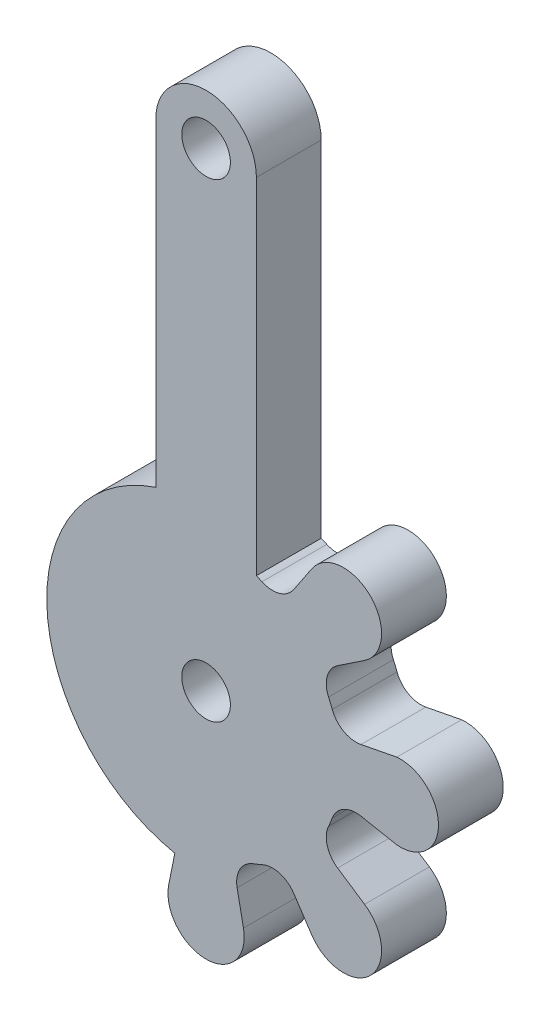
ISO-10303-21;
HEADER;
FILE_DESCRIPTION(('STEP AP214'),'2;1');
FILE_NAME('part.step','',(''),(''),'','','');
FILE_SCHEMA(('AUTOMOTIVE_DESIGN { 1 0 10303 214 1 1 1 1 }'));
ENDSEC;
DATA;
#1=APPLICATION_CONTEXT('core data for automotive mechanical design processes');
#2=APPLICATION_PROTOCOL_DEFINITION('international standard','automotive_design',2000,#1);
#3=PRODUCT_CONTEXT('',#1,'mechanical');
#4=PRODUCT('Part','Part','',(#3));
#5=PRODUCT_RELATED_PRODUCT_CATEGORY('part','',(#4));
#6=PRODUCT_DEFINITION_FORMATION('','',#4);
#7=PRODUCT_DEFINITION_CONTEXT('part definition',#1,'design');
#8=PRODUCT_DEFINITION('design','',#6,#7);
#9=PRODUCT_DEFINITION_SHAPE('','',#8);
#10=(LENGTH_UNIT() NAMED_UNIT(*) SI_UNIT(.MILLI.,.METRE.));
#11=(NAMED_UNIT(*) PLANE_ANGLE_UNIT() SI_UNIT($,.RADIAN.));
#12=(NAMED_UNIT(*) SI_UNIT($,.STERADIAN.) SOLID_ANGLE_UNIT());
#13=UNCERTAINTY_MEASURE_WITH_UNIT(LENGTH_MEASURE(1.E-05),#10,'distance_accuracy_value','');
#14=(GEOMETRIC_REPRESENTATION_CONTEXT(3) GLOBAL_UNCERTAINTY_ASSIGNED_CONTEXT((#13)) GLOBAL_UNIT_ASSIGNED_CONTEXT((#10,
#11,#12)) REPRESENTATION_CONTEXT('',''));
#15=CARTESIAN_POINT('',(0.,0.,0.));
#16=DIRECTION('',(0.,0.,1.));
#17=DIRECTION('',(1.,0.,0.));
#18=AXIS2_PLACEMENT_3D('',#15,#16,#17);
#19=CARTESIAN_POINT('',(13.9321787238471,5.32807153857671,4.));
#20=DIRECTION('',(0.,0.,1.));
#21=DIRECTION('',(1.,0.,0.));
#22=AXIS2_PLACEMENT_3D('',#19,#20,#21);
#23=PLANE('',#22);
#24=CARTESIAN_POINT('',(9.8292801499656,14.3157003697505,4.));
#25=DIRECTION('',(0.,0.,1.));
#26=DIRECTION('',(1.,0.,0.));
#27=AXIS2_PLACEMENT_3D('',#24,#25,#26);
#28=CIRCLE('',#27,1.50000000000068);
#29=CARTESIAN_POINT('',(11.3292801499663,14.3157003697505,4.));
#30=VERTEX_POINT('',#29);
#31=EDGE_CURVE('E247',#30,#30,#28,.T.);
#32=ORIENTED_EDGE('',*,*,#31,.F.);
#33=EDGE_LOOP('',(#32));
#34=FACE_BOUND('',#33,.T.);
#35=CARTESIAN_POINT('',(13.9321787238471,5.32807153857671,4.));
#36=DIRECTION('',(0.,0.,-1.));
#37=DIRECTION('',(1.,0.,0.));
#38=AXIS2_PLACEMENT_3D('',#35,#36,#37);
#39=CIRCLE('',#38,1.56930132758327);
#40=CARTESIAN_POINT('',(13.2804795223911,6.75565509478481,4.));
#41=VERTEX_POINT('',#40);
#42=CARTESIAN_POINT('',(15.238123377051,6.19825268038543,4.));
#43=VERTEX_POINT('',#42);
#44=EDGE_CURVE('E299',#41,#43,#39,.T.);
#45=ORIENTED_EDGE('',*,*,#44,.T.);
#46=DIRECTION('',(0.554502265815547,-0.832182213944413,0.));
#47=VECTOR('',#46,1.);
#48=CARTESIAN_POINT('',(15.238123377051,6.19825268038543,4.));
#49=LINE('',#48,#47);
#50=CARTESIAN_POINT('',(16.347575877791,4.53321595240375,4.));
#51=VERTEX_POINT('',#50);
#52=EDGE_CURVE('E149',#43,#51,#49,.T.);
#53=ORIENTED_EDGE('',*,*,#52,.T.);
#54=CARTESIAN_POINT('',(18.3064928575966,5.83848766511686,4.));
#55=DIRECTION('',(0.,0.,1.));
#56=DIRECTION('',(1.,0.,0.));
#57=AXIS2_PLACEMENT_3D('',#54,#55,#56);
#58=CIRCLE('',#57,2.35395199212414);
#59=CARTESIAN_POINT('',(19.6117645707153,7.79740464553143,4.));
#60=VERTEX_POINT('',#59);
#61=EDGE_CURVE('E370',#51,#60,#58,.T.);
#62=ORIENTED_EDGE('',*,*,#61,.T.);
#63=DIRECTION('',(-0.832182213937977,0.554502265825206,0.));
#64=VECTOR('',#63,1.);
#65=CARTESIAN_POINT('',(19.6117645703094,7.79740464492227,4.));
#66=LINE('',#65,#64);
#67=CARTESIAN_POINT('',(17.9467278431534,8.90685714513997,4.));
#68=VERTEX_POINT('',#67);
#69=EDGE_CURVE('E391',#60,#68,#66,.T.);
#70=ORIENTED_EDGE('',*,*,#69,.T.);
#71=CARTESIAN_POINT('',(18.8169089841364,10.212801798866,4.));
#72=DIRECTION('',(0.,0.,-1.));
#73=DIRECTION('',(1.,0.,0.));
#74=AXIS2_PLACEMENT_3D('',#71,#72,#73);
#75=CIRCLE('',#74,1.56930132908232);
#76=CARTESIAN_POINT('',(17.3893254268235,10.864500999686,4.));
#77=VERTEX_POINT('',#76);
#78=EDGE_CURVE('E388',#68,#77,#75,.T.);
#79=ORIENTED_EDGE('',*,*,#78,.T.);
#80=CARTESIAN_POINT('',(9.8292801499656,14.3157003697505,4.));
#81=DIRECTION('',(0.,0.,1.));
#82=DIRECTION('',(1.,0.,0.));
#83=AXIS2_PLACEMENT_3D('',#80,#81,#82);
#84=CIRCLE('',#83,8.31053919231774);
#85=CARTESIAN_POINT('',(17.615405909383,11.4103075691836,4.));
#86=VERTEX_POINT('',#85);
#87=EDGE_CURVE('E390',#77,#86,#84,.T.);
#88=ORIENTED_EDGE('',*,*,#87,.T.);
#89=CARTESIAN_POINT('',(19.0856808472915,10.8616744805369,4.));
#90=DIRECTION('',(0.,0.,-1.));
#91=DIRECTION('',(1.,0.,0.));
#92=AXIS2_PLACEMENT_3D('',#89,#90,#91);
#93=CIRCLE('',#92,1.56930132735953);
#94=CARTESIAN_POINT('',(19.3938121838805,12.4004277861269,4.));
#95=VERTEX_POINT('',#94);
#96=EDGE_CURVE('E393',#86,#95,#93,.T.);
#97=ORIENTED_EDGE('',*,*,#96,.T.);
#98=DIRECTION('',(0.981664134892741,-0.190618798299869,0.));
#99=VECTOR('',#98,1.);
#100=CARTESIAN_POINT('',(19.3938121838389,12.400427785919,4.));
#101=LINE('',#100,#99);
#102=CARTESIAN_POINT('',(21.6017659324175,11.9716889991019,4.));
#103=VERTEX_POINT('',#102);
#104=EDGE_CURVE('E399',#95,#103,#101,.T.);
#105=ORIENTED_EDGE('',*,*,#104,.T.);
#106=CARTESIAN_POINT('',(21.8178693311427,14.3157003697505,4.));
#107=DIRECTION('',(0.,0.,1.));
#108=DIRECTION('',(1.,0.,0.));
#109=AXIS2_PLACEMENT_3D('',#106,#107,#108);
#110=CIRCLE('',#109,2.35395199285594);
#111=CARTESIAN_POINT('',(21.6017659324176,16.6597117403991,4.));
#112=VERTEX_POINT('',#111);
#113=EDGE_CURVE('E401',#103,#112,#110,.T.);
#114=ORIENTED_EDGE('',*,*,#113,.T.);
#115=DIRECTION('',(-0.981664135105262,-0.190618797205412,0.));
#116=VECTOR('',#115,1.);
#117=CARTESIAN_POINT('',(21.6017659324176,16.6597117403991,4.));
#118=LINE('',#117,#116);
#119=CARTESIAN_POINT('',(19.3938121821458,16.2309729558077,4.));
#120=VERTEX_POINT('',#119);
#121=EDGE_CURVE('E403',#112,#120,#118,.T.);
#122=ORIENTED_EDGE('',*,*,#121,.T.);
#123=CARTESIAN_POINT('',(19.0856808472915,17.7697262619614,4.));
#124=DIRECTION('',(0.,0.,-1.));
#125=DIRECTION('',(1.,0.,0.));
#126=AXIS2_PLACEMENT_3D('',#123,#124,#125);
#127=CIRCLE('',#126,1.56930132882255);
#128=CARTESIAN_POINT('',(17.6154059088652,17.2210931732038,4.));
#129=VERTEX_POINT('',#128);
#130=EDGE_CURVE('E405',#120,#129,#127,.T.);
#131=ORIENTED_EDGE('',*,*,#130,.T.);
#132=CARTESIAN_POINT('',(9.8292801499656,14.3157003697505,4.));
#133=DIRECTION('',(0.,0.,1.));
#134=DIRECTION('',(1.,0.,0.));
#135=AXIS2_PLACEMENT_3D('',#132,#133,#134);
#136=CIRCLE('',#135,8.31053919372383);
#137=CARTESIAN_POINT('',(17.3893254266881,17.7668997416103,4.));
#138=VERTEX_POINT('',#137);
#139=EDGE_CURVE('E407',#129,#138,#136,.T.);
#140=ORIENTED_EDGE('',*,*,#139,.T.);
#141=CARTESIAN_POINT('',(18.8169089841364,18.4185989436325,4.));
#142=DIRECTION('',(0.,0.,-1.));
#143=DIRECTION('',(1.,0.,0.));
#144=AXIS2_PLACEMENT_3D('',#141,#142,#143);
#145=CIRCLE('',#144,1.56930132758312);
#146=CARTESIAN_POINT('',(17.9467278423342,19.7245435968265,4.));
#147=VERTEX_POINT('',#146);
#148=EDGE_CURVE('E409',#138,#147,#145,.T.);
#149=ORIENTED_EDGE('',*,*,#148,.T.);
#150=DIRECTION('',(0.832182214350146,0.554502265206633,0.));
#151=VECTOR('',#150,1.);
#152=CARTESIAN_POINT('',(17.9467278423278,19.7245435968361,4.));
#153=LINE('',#152,#151);
#154=CARTESIAN_POINT('',(19.611764569902,20.8339960955454,4.));
#155=VERTEX_POINT('',#154);
#156=EDGE_CURVE('E411',#147,#155,#153,.T.);
#157=ORIENTED_EDGE('',*,*,#156,.T.);
#158=CARTESIAN_POINT('',(18.3064928575966,22.7929130773815,4.));
#159=DIRECTION('',(0.,0.,1.));
#160=DIRECTION('',(1.,0.,0.));
#161=AXIS2_PLACEMENT_3D('',#158,#159,#160);
#162=CIRCLE('',#161,2.35395199285594);
#163=CARTESIAN_POINT('',(16.347575877182,24.0981847905003,4.));
#164=VERTEX_POINT('',#163);
#165=EDGE_CURVE('E413',#155,#164,#162,.T.);
#166=ORIENTED_EDGE('',*,*,#165,.T.);
#167=DIRECTION('',(-0.554502265825275,-0.832182213937931,0.));
#168=VECTOR('',#167,1.);
#169=CARTESIAN_POINT('',(16.347575877791,24.0981847900945,4.));
#170=LINE('',#169,#168);
#171=CARTESIAN_POINT('',(15.2381233775731,22.4331480629386,4.));
#172=VERTEX_POINT('',#171);
#173=EDGE_CURVE('E415',#164,#172,#170,.T.);
#174=ORIENTED_EDGE('',*,*,#173,.T.);
#175=CARTESIAN_POINT('',(13.9321787238471,23.3033292039215,4.));
#176=DIRECTION('',(0.,0.,-1.));
#177=DIRECTION('',(1.,0.,0.));
#178=AXIS2_PLACEMENT_3D('',#175,#176,#177);
#179=CIRCLE('',#178,1.56930132970473);
#180=CARTESIAN_POINT('',(13.2804795202887,21.8757456471746,4.));
#181=VERTEX_POINT('',#180);
#182=EDGE_CURVE('E417',#172,#181,#179,.T.);
#183=ORIENTED_EDGE('',*,*,#182,.T.);
#184=CARTESIAN_POINT('',(9.8292801499656,14.3157003697505,4.));
#185=DIRECTION('',(0.,0.,1.));
#186=DIRECTION('',(1.,0.,0.));
#187=AXIS2_PLACEMENT_3D('',#184,#185,#186);
#188=CIRCLE('',#187,8.31053919159069);
#189=CARTESIAN_POINT('',(12.9342801499661,22.024399135104,4.));
#190=VERTEX_POINT('',#189);
#191=EDGE_CURVE('E419',#181,#190,#188,.T.);
#192=ORIENTED_EDGE('',*,*,#191,.T.);
#193=DIRECTION('',(0.,1.,0.));
#194=VECTOR('',#193,1.);
#195=CARTESIAN_POINT('',(12.9342801499661,43.3157003697502,4.));
#196=LINE('',#195,#194);
#197=CARTESIAN_POINT('',(12.9342801499661,43.3157003697502,4.));
#198=VERTEX_POINT('',#197);
#199=EDGE_CURVE('E421',#190,#198,#196,.T.);
#200=ORIENTED_EDGE('',*,*,#199,.T.);
#201=CARTESIAN_POINT('',(9.82928014996628,43.3157003697502,4.));
#202=DIRECTION('',(0.,0.,1.));
#203=DIRECTION('',(1.,0.,0.));
#204=AXIS2_PLACEMENT_3D('',#201,#202,#203);
#205=CIRCLE('',#204,3.10499999999993);
#206=CARTESIAN_POINT('',(6.72428014996635,43.3157003697502,4.));
#207=VERTEX_POINT('',#206);
#208=EDGE_CURVE('E423',#198,#207,#205,.T.);
#209=ORIENTED_EDGE('',*,*,#208,.T.);
#210=DIRECTION('',(0.,-1.,0.));
#211=VECTOR('',#210,1.);
#212=CARTESIAN_POINT('',(6.72428014996626,43.3157003697502,4.));
#213=LINE('',#212,#211);
#214=CARTESIAN_POINT('',(6.72428014996626,23.6450642950133,4.));
#215=VERTEX_POINT('',#214);
#216=EDGE_CURVE('E425',#207,#215,#213,.T.);
#217=ORIENTED_EDGE('',*,*,#216,.T.);
#218=CARTESIAN_POINT('',(9.8292801499656,14.3157003697505,4.));
#219=DIRECTION('',(0.,0.,1.));
#220=DIRECTION('',(1.,0.,0.));
#221=AXIS2_PLACEMENT_3D('',#218,#219,#220);
#222=CIRCLE('',#221,9.83249999999987);
#223=CARTESIAN_POINT('',(7.89867492113485,4.67459982570427,4.));
#224=VERTEX_POINT('',#223);
#225=EDGE_CURVE('E427',#215,#224,#222,.T.);
#226=ORIENTED_EDGE('',*,*,#225,.T.);
#227=DIRECTION('',(-0.196349375445594,-0.9805339987793,0.));
#228=VECTOR('',#227,1.);
#229=CARTESIAN_POINT('',(7.89867492113478,4.67459982570393,4.));
#230=LINE('',#229,#228);
#231=CARTESIAN_POINT('',(7.5211501892657,2.78930819114894,4.));
#232=VERTEX_POINT('',#231);
#233=EDGE_CURVE('E429',#224,#232,#230,.T.);
#234=ORIENTED_EDGE('',*,*,#233,.T.);
#235=CARTESIAN_POINT('',(9.8292801499656,2.32711118857324,4.));
#236=DIRECTION('',(0.,0.,1.));
#237=DIRECTION('',(1.,0.,0.));
#238=AXIS2_PLACEMENT_3D('',#235,#236,#237);
#239=CIRCLE('',#238,2.35395199285594);
#240=CARTESIAN_POINT('',(12.1374101114198,2.78930819317041,4.));
#241=VERTEX_POINT('',#240);
#242=EDGE_CURVE('E225',#232,#241,#239,.T.);
#243=ORIENTED_EDGE('',*,*,#242,.T.);
#244=DIRECTION('',(-0.196349375314156,0.980533998805621,0.));
#245=VECTOR('',#244,1.);
#246=CARTESIAN_POINT('',(12.1374101125343,2.78930819339357,4.));
#247=LINE('',#246,#245);
#248=CARTESIAN_POINT('',(11.7445527360226,4.75116834056718,4.));
#249=VERTEX_POINT('',#248);
#250=EDGE_CURVE('E219',#241,#249,#247,.T.);
#251=ORIENTED_EDGE('',*,*,#250,.T.);
#252=CARTESIAN_POINT('',(13.2833060421763,5.05929967542149,4.));
#253=DIRECTION('',(0.,0.,-1.));
#254=DIRECTION('',(1.,0.,0.));
#255=AXIS2_PLACEMENT_3D('',#252,#253,#254);
#256=CIRCLE('',#255,1.56930132741864);
#257=CARTESIAN_POINT('',(12.7346729529282,6.52957461216632,4.));
#258=VERTEX_POINT('',#257);
#259=EDGE_CURVE('E223',#249,#258,#256,.T.);
#260=ORIENTED_EDGE('',*,*,#259,.T.);
#261=CARTESIAN_POINT('',(9.8292801499656,14.3157003697505,4.));
#262=DIRECTION('',(0.,0.,1.));
#263=DIRECTION('',(1.,0.,0.));
#264=AXIS2_PLACEMENT_3D('',#261,#262,#263);
#265=CIRCLE('',#264,8.31053919236058);
#266=EDGE_CURVE('E49',#258,#41,#265,.T.);
#267=ORIENTED_EDGE('',*,*,#266,.T.);
#268=EDGE_LOOP('',(#45,#53,#62,#70,#79,#88,#97,#105,#114,#122,#131,#140,#149,#157,#166,#174,
#183,#192,#200,#209,#217,#226,#234,#243,#251,#260,#267));
#269=FACE_BOUND('',#268,.T.);
#270=CARTESIAN_POINT('',(9.82928014996628,43.3157003697502,4.));
#271=DIRECTION('',(0.,0.,1.));
#272=DIRECTION('',(1.,0.,0.));
#273=AXIS2_PLACEMENT_3D('',#270,#271,#272);
#274=CIRCLE('',#273,1.5);
#275=CARTESIAN_POINT('',(11.3292801499663,43.3157003697502,4.));
#276=VERTEX_POINT('',#275);
#277=EDGE_CURVE('E808',#276,#276,#274,.T.);
#278=ORIENTED_EDGE('',*,*,#277,.F.);
#279=EDGE_LOOP('',(#278));
#280=FACE_BOUND('',#279,.T.);
#281=ADVANCED_FACE('F32',(#34,#269,#280),#23,.T.);
#282=CARTESIAN_POINT('',(13.9321787238471,5.32807153857671,0.));
#283=DIRECTION('',(0.,0.,1.));
#284=DIRECTION('',(1.,0.,0.));
#285=AXIS2_PLACEMENT_3D('',#282,#283,#284);
#286=PLANE('',#285);
#287=CARTESIAN_POINT('',(9.8292801499656,14.3157003697505,0.));
#288=DIRECTION('',(0.,0.,1.));
#289=DIRECTION('',(1.,0.,0.));
#290=AXIS2_PLACEMENT_3D('',#287,#288,#289);
#291=CIRCLE('',#290,1.50000000000068);
#292=CARTESIAN_POINT('',(11.3292801499663,14.3157003697505,0.));
#293=VERTEX_POINT('',#292);
#294=EDGE_CURVE('E805',#293,#293,#291,.T.);
#295=ORIENTED_EDGE('',*,*,#294,.T.);
#296=EDGE_LOOP('',(#295));
#297=FACE_BOUND('',#296,.T.);
#298=CARTESIAN_POINT('',(13.9321787238471,5.32807153857671,0.));
#299=DIRECTION('',(0.,0.,-1.));
#300=DIRECTION('',(1.,0.,0.));
#301=AXIS2_PLACEMENT_3D('',#298,#299,#300);
#302=CIRCLE('',#301,1.56930132758327);
#303=CARTESIAN_POINT('',(13.2804795223911,6.75565509478481,0.));
#304=VERTEX_POINT('',#303);
#305=CARTESIAN_POINT('',(15.238123377051,6.19825268038543,0.));
#306=VERTEX_POINT('',#305);
#307=EDGE_CURVE('E243',#304,#306,#302,.T.);
#308=ORIENTED_EDGE('',*,*,#307,.F.);
#309=CARTESIAN_POINT('',(9.8292801499656,14.3157003697505,0.));
#310=DIRECTION('',(0.,0.,1.));
#311=DIRECTION('',(1.,0.,0.));
#312=AXIS2_PLACEMENT_3D('',#309,#310,#311);
#313=CIRCLE('',#312,8.31053919236058);
#314=CARTESIAN_POINT('',(12.7346729529282,6.52957461216632,0.));
#315=VERTEX_POINT('',#314);
#316=EDGE_CURVE('E141',#315,#304,#313,.T.);
#317=ORIENTED_EDGE('',*,*,#316,.F.);
#318=CARTESIAN_POINT('',(13.2833060421763,5.05929967542149,0.));
#319=DIRECTION('',(0.,0.,-1.));
#320=DIRECTION('',(1.,0.,0.));
#321=AXIS2_PLACEMENT_3D('',#318,#319,#320);
#322=CIRCLE('',#321,1.56930132741864);
#323=CARTESIAN_POINT('',(11.7445527360226,4.75116834056718,0.));
#324=VERTEX_POINT('',#323);
#325=EDGE_CURVE('E135',#324,#315,#322,.T.);
#326=ORIENTED_EDGE('',*,*,#325,.F.);
#327=DIRECTION('',(-0.196349375314156,0.980533998805621,0.));
#328=VECTOR('',#327,1.);
#329=CARTESIAN_POINT('',(12.1374101125343,2.78930819339357,0.));
#330=LINE('',#329,#328);
#331=CARTESIAN_POINT('',(12.1374101114198,2.78930819317041,0.));
#332=VERTEX_POINT('',#331);
#333=EDGE_CURVE('E233',#332,#324,#330,.T.);
#334=ORIENTED_EDGE('',*,*,#333,.F.);
#335=CARTESIAN_POINT('',(9.8292801499656,2.32711118857324,0.));
#336=DIRECTION('',(0.,0.,1.));
#337=DIRECTION('',(1.,0.,0.));
#338=AXIS2_PLACEMENT_3D('',#335,#336,#337);
#339=CIRCLE('',#338,2.35395199399251);
#340=CARTESIAN_POINT('',(7.5211501892657,2.78930819114894,0.));
#341=VERTEX_POINT('',#340);
#342=EDGE_CURVE('E294',#341,#332,#339,.T.);
#343=ORIENTED_EDGE('',*,*,#342,.F.);
#344=DIRECTION('',(-0.196349375445594,-0.9805339987793,0.));
#345=VECTOR('',#344,1.);
#346=CARTESIAN_POINT('',(7.89867492113478,4.67459982570393,0.));
#347=LINE('',#346,#345);
#348=CARTESIAN_POINT('',(7.89867492113485,4.67459982570427,0.));
#349=VERTEX_POINT('',#348);
#350=EDGE_CURVE('E291',#349,#341,#347,.T.);
#351=ORIENTED_EDGE('',*,*,#350,.F.);
#352=CARTESIAN_POINT('',(9.8292801499656,14.3157003697505,0.));
#353=DIRECTION('',(0.,0.,1.));
#354=DIRECTION('',(1.,0.,0.));
#355=AXIS2_PLACEMENT_3D('',#352,#353,#354);
#356=CIRCLE('',#355,9.83249999999987);
#357=CARTESIAN_POINT('',(6.72428014996626,23.6450642950133,0.));
#358=VERTEX_POINT('',#357);
#359=EDGE_CURVE('E289',#358,#349,#356,.T.);
#360=ORIENTED_EDGE('',*,*,#359,.F.);
#361=DIRECTION('',(0.,-1.,0.));
#362=VECTOR('',#361,1.);
#363=CARTESIAN_POINT('',(6.72428014996626,43.3157003697502,0.));
#364=LINE('',#363,#362);
#365=CARTESIAN_POINT('',(6.72428014996635,43.3157003697502,0.));
#366=VERTEX_POINT('',#365);
#367=EDGE_CURVE('E287',#366,#358,#364,.T.);
#368=ORIENTED_EDGE('',*,*,#367,.F.);
#369=CARTESIAN_POINT('',(9.82928014996628,43.3157003697502,0.));
#370=DIRECTION('',(0.,0.,1.));
#371=DIRECTION('',(1.,0.,0.));
#372=AXIS2_PLACEMENT_3D('',#369,#370,#371);
#373=CIRCLE('',#372,3.10499999999993);
#374=CARTESIAN_POINT('',(12.9342801499661,43.3157003697502,0.));
#375=VERTEX_POINT('',#374);
#376=EDGE_CURVE('E285',#375,#366,#373,.T.);
#377=ORIENTED_EDGE('',*,*,#376,.F.);
#378=DIRECTION('',(0.,1.,0.));
#379=VECTOR('',#378,1.);
#380=CARTESIAN_POINT('',(12.9342801499661,43.3157003697502,0.));
#381=LINE('',#380,#379);
#382=CARTESIAN_POINT('',(12.9342801499661,22.024399135104,0.));
#383=VERTEX_POINT('',#382);
#384=EDGE_CURVE('E283',#383,#375,#381,.T.);
#385=ORIENTED_EDGE('',*,*,#384,.F.);
#386=CARTESIAN_POINT('',(9.8292801499656,14.3157003697505,0.));
#387=DIRECTION('',(0.,0.,1.));
#388=DIRECTION('',(1.,0.,0.));
#389=AXIS2_PLACEMENT_3D('',#386,#387,#388);
#390=CIRCLE('',#389,8.31053919159069);
#391=CARTESIAN_POINT('',(13.2804795202887,21.8757456471746,0.));
#392=VERTEX_POINT('',#391);
#393=EDGE_CURVE('E281',#392,#383,#390,.T.);
#394=ORIENTED_EDGE('',*,*,#393,.F.);
#395=CARTESIAN_POINT('',(13.9321787238471,23.3033292039215,0.));
#396=DIRECTION('',(0.,0.,-1.));
#397=DIRECTION('',(1.,0.,0.));
#398=AXIS2_PLACEMENT_3D('',#395,#396,#397);
#399=CIRCLE('',#398,1.56930132970473);
#400=CARTESIAN_POINT('',(15.2381233775731,22.4331480629386,0.));
#401=VERTEX_POINT('',#400);
#402=EDGE_CURVE('E279',#401,#392,#399,.T.);
#403=ORIENTED_EDGE('',*,*,#402,.F.);
#404=DIRECTION('',(-0.554502265825275,-0.832182213937931,0.));
#405=VECTOR('',#404,1.);
#406=CARTESIAN_POINT('',(16.347575877791,24.0981847900945,0.));
#407=LINE('',#406,#405);
#408=CARTESIAN_POINT('',(16.347575877182,24.0981847905003,0.));
#409=VERTEX_POINT('',#408);
#410=EDGE_CURVE('E277',#409,#401,#407,.T.);
#411=ORIENTED_EDGE('',*,*,#410,.F.);
#412=CARTESIAN_POINT('',(18.3064928575966,22.7929130773815,0.));
#413=DIRECTION('',(0.,0.,1.));
#414=DIRECTION('',(1.,0.,0.));
#415=AXIS2_PLACEMENT_3D('',#412,#413,#414);
#416=CIRCLE('',#415,2.35395199212412);
#417=CARTESIAN_POINT('',(19.611764569902,20.8339960955454,0.));
#418=VERTEX_POINT('',#417);
#419=EDGE_CURVE('E275',#418,#409,#416,.T.);
#420=ORIENTED_EDGE('',*,*,#419,.F.);
#421=DIRECTION('',(0.832182214350146,0.554502265206633,0.));
#422=VECTOR('',#421,1.);
#423=CARTESIAN_POINT('',(17.9467278423278,19.7245435968361,0.));
#424=LINE('',#423,#422);
#425=CARTESIAN_POINT('',(17.9467278423342,19.7245435968265,0.));
#426=VERTEX_POINT('',#425);
#427=EDGE_CURVE('E272',#426,#418,#424,.T.);
#428=ORIENTED_EDGE('',*,*,#427,.F.);
#429=CARTESIAN_POINT('',(18.8169089841364,18.4185989436325,0.));
#430=DIRECTION('',(0.,0.,-1.));
#431=DIRECTION('',(1.,0.,0.));
#432=AXIS2_PLACEMENT_3D('',#429,#430,#431);
#433=CIRCLE('',#432,1.56930132758312);
#434=CARTESIAN_POINT('',(17.3893254266881,17.7668997416103,0.));
#435=VERTEX_POINT('',#434);
#436=EDGE_CURVE('E270',#435,#426,#433,.T.);
#437=ORIENTED_EDGE('',*,*,#436,.F.);
#438=CARTESIAN_POINT('',(9.8292801499656,14.3157003697505,0.));
#439=DIRECTION('',(0.,0.,1.));
#440=DIRECTION('',(1.,0.,0.));
#441=AXIS2_PLACEMENT_3D('',#438,#439,#440);
#442=CIRCLE('',#441,8.31053919372383);
#443=CARTESIAN_POINT('',(17.6154059088652,17.2210931732038,0.));
#444=VERTEX_POINT('',#443);
#445=EDGE_CURVE('E268',#444,#435,#442,.T.);
#446=ORIENTED_EDGE('',*,*,#445,.F.);
#447=CARTESIAN_POINT('',(19.0856808472915,17.7697262619614,0.));
#448=DIRECTION('',(0.,0.,-1.));
#449=DIRECTION('',(1.,0.,0.));
#450=AXIS2_PLACEMENT_3D('',#447,#448,#449);
#451=CIRCLE('',#450,1.56930132882255);
#452=CARTESIAN_POINT('',(19.3938121821458,16.2309729558077,0.));
#453=VERTEX_POINT('',#452);
#454=EDGE_CURVE('E266',#453,#444,#451,.T.);
#455=ORIENTED_EDGE('',*,*,#454,.F.);
#456=DIRECTION('',(-0.981664135105262,-0.190618797205412,0.));
#457=VECTOR('',#456,1.);
#458=CARTESIAN_POINT('',(21.6017659324176,16.6597117403991,0.));
#459=LINE('',#458,#457);
#460=CARTESIAN_POINT('',(21.6017659324176,16.6597117403991,0.));
#461=VERTEX_POINT('',#460);
#462=EDGE_CURVE('E264',#461,#453,#459,.T.);
#463=ORIENTED_EDGE('',*,*,#462,.F.);
#464=CARTESIAN_POINT('',(21.8178693311427,14.3157003697505,0.));
#465=DIRECTION('',(0.,0.,1.));
#466=DIRECTION('',(1.,0.,0.));
#467=AXIS2_PLACEMENT_3D('',#464,#465,#466);
#468=CIRCLE('',#467,2.35395199285594);
#469=CARTESIAN_POINT('',(21.6017659324175,11.9716889991019,0.));
#470=VERTEX_POINT('',#469);
#471=EDGE_CURVE('E262',#470,#461,#468,.T.);
#472=ORIENTED_EDGE('',*,*,#471,.F.);
#473=DIRECTION('',(0.981664134892741,-0.190618798299869,0.));
#474=VECTOR('',#473,1.);
#475=CARTESIAN_POINT('',(19.3938121838389,12.400427785919,0.));
#476=LINE('',#475,#474);
#477=CARTESIAN_POINT('',(19.3938121838805,12.4004277861269,0.));
#478=VERTEX_POINT('',#477);
#479=EDGE_CURVE('E260',#478,#470,#476,.T.);
#480=ORIENTED_EDGE('',*,*,#479,.F.);
#481=CARTESIAN_POINT('',(19.0856808472915,10.8616744805369,0.));
#482=DIRECTION('',(0.,0.,-1.));
#483=DIRECTION('',(1.,0.,0.));
#484=AXIS2_PLACEMENT_3D('',#481,#482,#483);
#485=CIRCLE('',#484,1.56930132735953);
#486=CARTESIAN_POINT('',(17.615405909383,11.4103075691836,0.));
#487=VERTEX_POINT('',#486);
#488=EDGE_CURVE('E258',#487,#478,#485,.T.);
#489=ORIENTED_EDGE('',*,*,#488,.F.);
#490=CARTESIAN_POINT('',(9.8292801499656,14.3157003697505,0.));
#491=DIRECTION('',(0.,0.,1.));
#492=DIRECTION('',(1.,0.,0.));
#493=AXIS2_PLACEMENT_3D('',#490,#491,#492);
#494=CIRCLE('',#493,8.31053919231774);
#495=CARTESIAN_POINT('',(17.3893254268235,10.864500999686,0.));
#496=VERTEX_POINT('',#495);
#497=EDGE_CURVE('E256',#496,#487,#494,.T.);
#498=ORIENTED_EDGE('',*,*,#497,.F.);
#499=CARTESIAN_POINT('',(18.8169089841364,10.212801798866,0.));
#500=DIRECTION('',(0.,0.,-1.));
#501=DIRECTION('',(1.,0.,0.));
#502=AXIS2_PLACEMENT_3D('',#499,#500,#501);
#503=CIRCLE('',#502,1.56930132908232);
#504=CARTESIAN_POINT('',(17.9467278431534,8.90685714513997,0.));
#505=VERTEX_POINT('',#504);
#506=EDGE_CURVE('E254',#505,#496,#503,.T.);
#507=ORIENTED_EDGE('',*,*,#506,.F.);
#508=DIRECTION('',(-0.832182213937977,0.554502265825206,0.));
#509=VECTOR('',#508,1.);
#510=CARTESIAN_POINT('',(19.6117645703094,7.79740464492227,0.));
#511=LINE('',#510,#509);
#512=CARTESIAN_POINT('',(19.6117645707153,7.79740464553143,0.));
#513=VERTEX_POINT('',#512);
#514=EDGE_CURVE('E252',#513,#505,#511,.T.);
#515=ORIENTED_EDGE('',*,*,#514,.F.);
#516=CARTESIAN_POINT('',(18.3064928575966,5.83848766511686,0.));
#517=DIRECTION('',(0.,0.,1.));
#518=DIRECTION('',(1.,0.,0.));
#519=AXIS2_PLACEMENT_3D('',#516,#517,#518);
#520=CIRCLE('',#519,2.35395199212395);
#521=CARTESIAN_POINT('',(16.347575877791,4.53321595240375,0.));
#522=VERTEX_POINT('',#521);
#523=EDGE_CURVE('E250',#522,#513,#520,.T.);
#524=ORIENTED_EDGE('',*,*,#523,.F.);
#525=DIRECTION('',(0.554502265815547,-0.832182213944413,0.));
#526=VECTOR('',#525,1.);
#527=CARTESIAN_POINT('',(15.238123377051,6.19825268038543,0.));
#528=LINE('',#527,#526);
#529=EDGE_CURVE('E246',#306,#522,#528,.T.);
#530=ORIENTED_EDGE('',*,*,#529,.F.);
#531=EDGE_LOOP('',(#308,#317,#326,#334,#343,#351,#360,#368,#377,#385,#394,#403,#411,#420,#428,
#437,#446,#455,#463,#472,#480,#489,#498,#507,#515,#524,#530));
#532=FACE_BOUND('',#531,.T.);
#533=CARTESIAN_POINT('',(9.82928014996628,43.3157003697502,0.));
#534=DIRECTION('',(0.,0.,1.));
#535=DIRECTION('',(1.,0.,0.));
#536=AXIS2_PLACEMENT_3D('',#533,#534,#535);
#537=CIRCLE('',#536,1.5);
#538=CARTESIAN_POINT('',(11.3292801499663,43.3157003697502,0.));
#539=VERTEX_POINT('',#538);
#540=EDGE_CURVE('E811',#539,#539,#537,.T.);
#541=ORIENTED_EDGE('',*,*,#540,.T.);
#542=EDGE_LOOP('',(#541));
#543=FACE_BOUND('',#542,.T.);
#544=ADVANCED_FACE('F375',(#297,#532,#543),#286,.F.);
#545=CARTESIAN_POINT('',(13.9321787238471,5.32807153857671,4.));
#546=DIRECTION('',(0.,0.,-1.));
#547=DIRECTION('',(-1.,0.,0.));
#548=AXIS2_PLACEMENT_3D('',#545,#546,#547);
#549=CYLINDRICAL_SURFACE('',#548,1.56930132758327);
#550=ORIENTED_EDGE('',*,*,#307,.T.);
#551=DIRECTION('',(0.,0.,-1.));
#552=VECTOR('',#551,1.);
#553=CARTESIAN_POINT('',(15.238123377051,6.19825268038543,4.));
#554=LINE('',#553,#552);
#555=EDGE_CURVE('E11',#43,#306,#554,.T.);
#556=ORIENTED_EDGE('',*,*,#555,.F.);
#557=ORIENTED_EDGE('',*,*,#44,.F.);
#558=DIRECTION('',(0.,0.,-1.));
#559=VECTOR('',#558,1.);
#560=CARTESIAN_POINT('',(13.2804795223911,6.75565509478481,4.));
#561=LINE('',#560,#559);
#562=EDGE_CURVE('E239',#41,#304,#561,.T.);
#563=ORIENTED_EDGE('',*,*,#562,.T.);
#564=EDGE_LOOP('',(#550,#556,#557,#563));
#565=FACE_BOUND('',#564,.T.);
#566=ADVANCED_FACE('F34',(#565),#549,.F.);
#567=CARTESIAN_POINT('',(15.238123377051,6.19825268038543,4.));
#568=DIRECTION('',(0.832182213944413,0.554502265815547,0.));
#569=DIRECTION('',(-0.554502265815547,0.832182213944413,0.));
#570=AXIS2_PLACEMENT_3D('',#567,#568,#569);
#571=PLANE('',#570);
#572=ORIENTED_EDGE('',*,*,#529,.T.);
#573=DIRECTION('',(0.,0.,-1.));
#574=VECTOR('',#573,1.);
#575=CARTESIAN_POINT('',(16.347575877791,4.53321595240375,4.));
#576=LINE('',#575,#574);
#577=EDGE_CURVE('E41',#51,#522,#576,.T.);
#578=ORIENTED_EDGE('',*,*,#577,.F.);
#579=ORIENTED_EDGE('',*,*,#52,.F.);
#580=ORIENTED_EDGE('',*,*,#555,.T.);
#581=EDGE_LOOP('',(#572,#578,#579,#580));
#582=FACE_BOUND('',#581,.T.);
#583=ADVANCED_FACE('F371',(#582),#571,.F.);
#584=CARTESIAN_POINT('',(18.3064928575966,5.83848766511686,4.));
#585=DIRECTION('',(0.,0.,-1.));
#586=DIRECTION('',(-1.,0.,0.));
#587=AXIS2_PLACEMENT_3D('',#584,#585,#586);
#588=CYLINDRICAL_SURFACE('',#587,2.35395199212395);
#589=ORIENTED_EDGE('',*,*,#523,.T.);
#590=DIRECTION('',(0.,0.,-1.));
#591=VECTOR('',#590,1.);
#592=CARTESIAN_POINT('',(19.6117645707153,7.79740464553143,4.));
#593=LINE('',#592,#591);
#594=EDGE_CURVE('E363',#60,#513,#593,.T.);
#595=ORIENTED_EDGE('',*,*,#594,.F.);
#596=ORIENTED_EDGE('',*,*,#61,.F.);
#597=ORIENTED_EDGE('',*,*,#577,.T.);
#598=EDGE_LOOP('',(#589,#595,#596,#597));
#599=FACE_BOUND('',#598,.T.);
#600=ADVANCED_FACE('F368',(#599),#588,.T.);
#601=CARTESIAN_POINT('',(19.6117645703094,7.79740464492227,4.));
#602=DIRECTION('',(-0.554502265825206,-0.832182213937977,0.));
#603=DIRECTION('',(0.832182213937977,-0.554502265825206,0.));
#604=AXIS2_PLACEMENT_3D('',#601,#602,#603);
#605=PLANE('',#604);
#606=ORIENTED_EDGE('',*,*,#514,.T.);
#607=DIRECTION('',(0.,0.,-1.));
#608=VECTOR('',#607,1.);
#609=CARTESIAN_POINT('',(17.9467278431534,8.90685714513997,4.));
#610=LINE('',#609,#608);
#611=EDGE_CURVE('E360',#68,#505,#610,.T.);
#612=ORIENTED_EDGE('',*,*,#611,.F.);
#613=ORIENTED_EDGE('',*,*,#69,.F.);
#614=ORIENTED_EDGE('',*,*,#594,.T.);
#615=EDGE_LOOP('',(#606,#612,#613,#614));
#616=FACE_BOUND('',#615,.T.);
#617=ADVANCED_FACE('F382',(#616),#605,.F.);
#618=CARTESIAN_POINT('',(18.8169089841364,10.212801798866,4.));
#619=DIRECTION('',(0.,0.,-1.));
#620=DIRECTION('',(-1.,0.,0.));
#621=AXIS2_PLACEMENT_3D('',#618,#619,#620);
#622=CYLINDRICAL_SURFACE('',#621,1.56930132908232);
#623=ORIENTED_EDGE('',*,*,#506,.T.);
#624=DIRECTION('',(0.,0.,-1.));
#625=VECTOR('',#624,1.);
#626=CARTESIAN_POINT('',(17.3893254268235,10.864500999686,4.));
#627=LINE('',#626,#625);
#628=EDGE_CURVE('E357',#77,#496,#627,.T.);
#629=ORIENTED_EDGE('',*,*,#628,.F.);
#630=ORIENTED_EDGE('',*,*,#78,.F.);
#631=ORIENTED_EDGE('',*,*,#611,.T.);
#632=EDGE_LOOP('',(#623,#629,#630,#631));
#633=FACE_BOUND('',#632,.T.);
#634=ADVANCED_FACE('F386',(#633),#622,.F.);
#635=CARTESIAN_POINT('',(9.8292801499656,14.3157003697505,4.));
#636=DIRECTION('',(0.,0.,-1.));
#637=DIRECTION('',(-1.,0.,0.));
#638=AXIS2_PLACEMENT_3D('',#635,#636,#637);
#639=CYLINDRICAL_SURFACE('',#638,8.31053919231774);
#640=ORIENTED_EDGE('',*,*,#497,.T.);
#641=DIRECTION('',(0.,0.,-1.));
#642=VECTOR('',#641,1.);
#643=CARTESIAN_POINT('',(17.615405909383,11.4103075691836,4.));
#644=LINE('',#643,#642);
#645=EDGE_CURVE('E354',#86,#487,#644,.T.);
#646=ORIENTED_EDGE('',*,*,#645,.F.);
#647=ORIENTED_EDGE('',*,*,#87,.F.);
#648=ORIENTED_EDGE('',*,*,#628,.T.);
#649=EDGE_LOOP('',(#640,#646,#647,#648));
#650=FACE_BOUND('',#649,.T.);
#651=ADVANCED_FACE('F518',(#650),#639,.T.);
#652=CARTESIAN_POINT('',(19.0856808472915,10.8616744805369,4.));
#653=DIRECTION('',(0.,0.,-1.));
#654=DIRECTION('',(-1.,0.,0.));
#655=AXIS2_PLACEMENT_3D('',#652,#653,#654);
#656=CYLINDRICAL_SURFACE('',#655,1.56930132735953);
#657=ORIENTED_EDGE('',*,*,#488,.T.);
#658=DIRECTION('',(0.,0.,-1.));
#659=VECTOR('',#658,1.);
#660=CARTESIAN_POINT('',(19.3938121838805,12.4004277861269,4.));
#661=LINE('',#660,#659);
#662=EDGE_CURVE('E351',#95,#478,#661,.T.);
#663=ORIENTED_EDGE('',*,*,#662,.F.);
#664=ORIENTED_EDGE('',*,*,#96,.F.);
#665=ORIENTED_EDGE('',*,*,#645,.T.);
#666=EDGE_LOOP('',(#657,#663,#664,#665));
#667=FACE_BOUND('',#666,.T.);
#668=ADVANCED_FACE('F514',(#667),#656,.F.);
#669=CARTESIAN_POINT('',(19.3938121838389,12.400427785919,4.));
#670=DIRECTION('',(0.190618798299869,0.981664134892741,0.));
#671=DIRECTION('',(-0.981664134892741,0.190618798299869,0.));
#672=AXIS2_PLACEMENT_3D('',#669,#670,#671);
#673=PLANE('',#672);
#674=ORIENTED_EDGE('',*,*,#479,.T.);
#675=DIRECTION('',(0.,0.,-1.));
#676=VECTOR('',#675,1.);
#677=CARTESIAN_POINT('',(21.6017659324175,11.9716889991019,4.));
#678=LINE('',#677,#676);
#679=EDGE_CURVE('E348',#103,#470,#678,.T.);
#680=ORIENTED_EDGE('',*,*,#679,.F.);
#681=ORIENTED_EDGE('',*,*,#104,.F.);
#682=ORIENTED_EDGE('',*,*,#662,.T.);
#683=EDGE_LOOP('',(#674,#680,#681,#682));
#684=FACE_BOUND('',#683,.T.);
#685=ADVANCED_FACE('F510',(#684),#673,.F.);
#686=CARTESIAN_POINT('',(21.8178693311427,14.3157003697505,4.));
#687=DIRECTION('',(0.,0.,-1.));
#688=DIRECTION('',(-1.,0.,0.));
#689=AXIS2_PLACEMENT_3D('',#686,#687,#688);
#690=CYLINDRICAL_SURFACE('',#689,2.35395199285594);
#691=ORIENTED_EDGE('',*,*,#471,.T.);
#692=DIRECTION('',(0.,0.,-1.));
#693=VECTOR('',#692,1.);
#694=CARTESIAN_POINT('',(21.6017659324176,16.6597117403991,4.));
#695=LINE('',#694,#693);
#696=EDGE_CURVE('E345',#112,#461,#695,.T.);
#697=ORIENTED_EDGE('',*,*,#696,.F.);
#698=ORIENTED_EDGE('',*,*,#113,.F.);
#699=ORIENTED_EDGE('',*,*,#679,.T.);
#700=EDGE_LOOP('',(#691,#697,#698,#699));
#701=FACE_BOUND('',#700,.T.);
#702=ADVANCED_FACE('F506',(#701),#690,.T.);
#703=CARTESIAN_POINT('',(21.6017659324176,16.6597117403991,4.));
#704=DIRECTION('',(0.190618797205412,-0.981664135105262,0.));
#705=DIRECTION('',(0.981664135105262,0.190618797205412,0.));
#706=AXIS2_PLACEMENT_3D('',#703,#704,#705);
#707=PLANE('',#706);
#708=ORIENTED_EDGE('',*,*,#462,.T.);
#709=DIRECTION('',(0.,0.,-1.));
#710=VECTOR('',#709,1.);
#711=CARTESIAN_POINT('',(19.3938121821458,16.2309729558077,4.));
#712=LINE('',#711,#710);
#713=EDGE_CURVE('E342',#120,#453,#712,.T.);
#714=ORIENTED_EDGE('',*,*,#713,.F.);
#715=ORIENTED_EDGE('',*,*,#121,.F.);
#716=ORIENTED_EDGE('',*,*,#696,.T.);
#717=EDGE_LOOP('',(#708,#714,#715,#716));
#718=FACE_BOUND('',#717,.T.);
#719=ADVANCED_FACE('F501',(#718),#707,.F.);
#720=CARTESIAN_POINT('',(19.0856808472915,17.7697262619614,4.));
#721=DIRECTION('',(0.,0.,-1.));
#722=DIRECTION('',(-1.,0.,0.));
#723=AXIS2_PLACEMENT_3D('',#720,#721,#722);
#724=CYLINDRICAL_SURFACE('',#723,1.56930132882255);
#725=ORIENTED_EDGE('',*,*,#454,.T.);
#726=DIRECTION('',(0.,0.,-1.));
#727=VECTOR('',#726,1.);
#728=CARTESIAN_POINT('',(17.6154059088652,17.2210931732038,4.));
#729=LINE('',#728,#727);
#730=EDGE_CURVE('E339',#129,#444,#729,.T.);
#731=ORIENTED_EDGE('',*,*,#730,.F.);
#732=ORIENTED_EDGE('',*,*,#130,.F.);
#733=ORIENTED_EDGE('',*,*,#713,.T.);
#734=EDGE_LOOP('',(#725,#731,#732,#733));
#735=FACE_BOUND('',#734,.T.);
#736=ADVANCED_FACE('F495',(#735),#724,.F.);
#737=CARTESIAN_POINT('',(9.8292801499656,14.3157003697505,4.));
#738=DIRECTION('',(0.,0.,-1.));
#739=DIRECTION('',(-1.,0.,0.));
#740=AXIS2_PLACEMENT_3D('',#737,#738,#739);
#741=CYLINDRICAL_SURFACE('',#740,8.31053919372383);
#742=ORIENTED_EDGE('',*,*,#445,.T.);
#743=DIRECTION('',(0.,0.,-1.));
#744=VECTOR('',#743,1.);
#745=CARTESIAN_POINT('',(17.3893254266881,17.7668997416103,4.));
#746=LINE('',#745,#744);
#747=EDGE_CURVE('E336',#138,#435,#746,.T.);
#748=ORIENTED_EDGE('',*,*,#747,.F.);
#749=ORIENTED_EDGE('',*,*,#139,.F.);
#750=ORIENTED_EDGE('',*,*,#730,.T.);
#751=EDGE_LOOP('',(#742,#748,#749,#750));
#752=FACE_BOUND('',#751,.T.);
#753=ADVANCED_FACE('F491',(#752),#741,.T.);
#754=CARTESIAN_POINT('',(18.8169089841364,18.4185989436325,4.));
#755=DIRECTION('',(0.,0.,-1.));
#756=DIRECTION('',(-1.,0.,0.));
#757=AXIS2_PLACEMENT_3D('',#754,#755,#756);
#758=CYLINDRICAL_SURFACE('',#757,1.56930132758312);
#759=ORIENTED_EDGE('',*,*,#436,.T.);
#760=DIRECTION('',(0.,0.,-1.));
#761=VECTOR('',#760,1.);
#762=CARTESIAN_POINT('',(17.9467278423342,19.7245435968265,4.));
#763=LINE('',#762,#761);
#764=EDGE_CURVE('E333',#147,#426,#763,.T.);
#765=ORIENTED_EDGE('',*,*,#764,.F.);
#766=ORIENTED_EDGE('',*,*,#148,.F.);
#767=ORIENTED_EDGE('',*,*,#747,.T.);
#768=EDGE_LOOP('',(#759,#765,#766,#767));
#769=FACE_BOUND('',#768,.T.);
#770=ADVANCED_FACE('F486',(#769),#758,.F.);
#771=CARTESIAN_POINT('',(17.9467278423278,19.7245435968361,4.));
#772=DIRECTION('',(-0.554502265206633,0.832182214350146,0.));
#773=DIRECTION('',(-0.832182214350146,-0.554502265206633,0.));
#774=AXIS2_PLACEMENT_3D('',#771,#772,#773);
#775=PLANE('',#774);
#776=ORIENTED_EDGE('',*,*,#427,.T.);
#777=DIRECTION('',(0.,0.,-1.));
#778=VECTOR('',#777,1.);
#779=CARTESIAN_POINT('',(19.611764569902,20.8339960955454,4.));
#780=LINE('',#779,#778);
#781=EDGE_CURVE('E330',#155,#418,#780,.T.);
#782=ORIENTED_EDGE('',*,*,#781,.F.);
#783=ORIENTED_EDGE('',*,*,#156,.F.);
#784=ORIENTED_EDGE('',*,*,#764,.T.);
#785=EDGE_LOOP('',(#776,#782,#783,#784));
#786=FACE_BOUND('',#785,.T.);
#787=ADVANCED_FACE('F480',(#786),#775,.F.);
#788=CARTESIAN_POINT('',(18.3064928575966,22.7929130773815,4.));
#789=DIRECTION('',(0.,0.,-1.));
#790=DIRECTION('',(-1.,0.,0.));
#791=AXIS2_PLACEMENT_3D('',#788,#789,#790);
#792=CYLINDRICAL_SURFACE('',#791,2.35395199212412);
#793=ORIENTED_EDGE('',*,*,#419,.T.);
#794=DIRECTION('',(0.,0.,-1.));
#795=VECTOR('',#794,1.);
#796=CARTESIAN_POINT('',(16.347575877182,24.0981847905003,4.));
#797=LINE('',#796,#795);
#798=EDGE_CURVE('E327',#164,#409,#797,.T.);
#799=ORIENTED_EDGE('',*,*,#798,.F.);
#800=ORIENTED_EDGE('',*,*,#165,.F.);
#801=ORIENTED_EDGE('',*,*,#781,.T.);
#802=EDGE_LOOP('',(#793,#799,#800,#801));
#803=FACE_BOUND('',#802,.T.);
#804=ADVANCED_FACE('F476',(#803),#792,.T.);
#805=CARTESIAN_POINT('',(16.347575877791,24.0981847900945,4.));
#806=DIRECTION('',(0.832182213937931,-0.554502265825275,0.));
#807=DIRECTION('',(0.554502265825275,0.832182213937931,0.));
#808=AXIS2_PLACEMENT_3D('',#805,#806,#807);
#809=PLANE('',#808);
#810=ORIENTED_EDGE('',*,*,#410,.T.);
#811=DIRECTION('',(0.,0.,-1.));
#812=VECTOR('',#811,1.);
#813=CARTESIAN_POINT('',(15.2381233775731,22.4331480629386,4.));
#814=LINE('',#813,#812);
#815=EDGE_CURVE('E324',#172,#401,#814,.T.);
#816=ORIENTED_EDGE('',*,*,#815,.F.);
#817=ORIENTED_EDGE('',*,*,#173,.F.);
#818=ORIENTED_EDGE('',*,*,#798,.T.);
#819=EDGE_LOOP('',(#810,#816,#817,#818));
#820=FACE_BOUND('',#819,.T.);
#821=ADVANCED_FACE('F471',(#820),#809,.F.);
#822=CARTESIAN_POINT('',(13.9321787238471,23.3033292039215,4.));
#823=DIRECTION('',(0.,0.,-1.));
#824=DIRECTION('',(-1.,0.,0.));
#825=AXIS2_PLACEMENT_3D('',#822,#823,#824);
#826=CYLINDRICAL_SURFACE('',#825,1.56930132970473);
#827=ORIENTED_EDGE('',*,*,#402,.T.);
#828=DIRECTION('',(0.,0.,-1.));
#829=VECTOR('',#828,1.);
#830=CARTESIAN_POINT('',(13.2804795202887,21.8757456471746,4.));
#831=LINE('',#830,#829);
#832=EDGE_CURVE('E321',#181,#392,#831,.T.);
#833=ORIENTED_EDGE('',*,*,#832,.F.);
#834=ORIENTED_EDGE('',*,*,#182,.F.);
#835=ORIENTED_EDGE('',*,*,#815,.T.);
#836=EDGE_LOOP('',(#827,#833,#834,#835));
#837=FACE_BOUND('',#836,.T.);
#838=ADVANCED_FACE('F466',(#837),#826,.F.);
#839=CARTESIAN_POINT('',(9.8292801499656,14.3157003697505,4.));
#840=DIRECTION('',(0.,0.,-1.));
#841=DIRECTION('',(-1.,0.,0.));
#842=AXIS2_PLACEMENT_3D('',#839,#840,#841);
#843=CYLINDRICAL_SURFACE('',#842,8.31053919159069);
#844=ORIENTED_EDGE('',*,*,#393,.T.);
#845=DIRECTION('',(0.,0.,-1.));
#846=VECTOR('',#845,1.);
#847=CARTESIAN_POINT('',(12.9342801499661,22.024399135104,4.));
#848=LINE('',#847,#846);
#849=EDGE_CURVE('E318',#190,#383,#848,.T.);
#850=ORIENTED_EDGE('',*,*,#849,.F.);
#851=ORIENTED_EDGE('',*,*,#191,.F.);
#852=ORIENTED_EDGE('',*,*,#832,.T.);
#853=EDGE_LOOP('',(#844,#850,#851,#852));
#854=FACE_BOUND('',#853,.T.);
#855=ADVANCED_FACE('F462',(#854),#843,.T.);
#856=CARTESIAN_POINT('',(12.9342801499661,43.3157003697502,4.));
#857=DIRECTION('',(-1.,0.,0.));
#858=DIRECTION('',(0.,-1.,0.));
#859=AXIS2_PLACEMENT_3D('',#856,#857,#858);
#860=PLANE('',#859);
#861=ORIENTED_EDGE('',*,*,#384,.T.);
#862=DIRECTION('',(0.,0.,-1.));
#863=VECTOR('',#862,1.);
#864=CARTESIAN_POINT('',(12.9342801499661,43.3157003697502,4.));
#865=LINE('',#864,#863);
#866=EDGE_CURVE('E315',#198,#375,#865,.T.);
#867=ORIENTED_EDGE('',*,*,#866,.F.);
#868=ORIENTED_EDGE('',*,*,#199,.F.);
#869=ORIENTED_EDGE('',*,*,#849,.T.);
#870=EDGE_LOOP('',(#861,#867,#868,#869));
#871=FACE_BOUND('',#870,.T.);
#872=ADVANCED_FACE('F457',(#871),#860,.F.);
#873=CARTESIAN_POINT('',(9.82928014996628,43.3157003697502,4.));
#874=DIRECTION('',(0.,0.,-1.));
#875=DIRECTION('',(-1.,0.,0.));
#876=AXIS2_PLACEMENT_3D('',#873,#874,#875);
#877=CYLINDRICAL_SURFACE('',#876,3.10499999999993);
#878=ORIENTED_EDGE('',*,*,#376,.T.);
#879=DIRECTION('',(0.,0.,-1.));
#880=VECTOR('',#879,1.);
#881=CARTESIAN_POINT('',(6.72428014996635,43.3157003697502,4.));
#882=LINE('',#881,#880);
#883=EDGE_CURVE('E312',#207,#366,#882,.T.);
#884=ORIENTED_EDGE('',*,*,#883,.F.);
#885=ORIENTED_EDGE('',*,*,#208,.F.);
#886=ORIENTED_EDGE('',*,*,#866,.T.);
#887=EDGE_LOOP('',(#878,#884,#885,#886));
#888=FACE_BOUND('',#887,.T.);
#889=ADVANCED_FACE('F451',(#888),#877,.T.);
#890=CARTESIAN_POINT('',(6.72428014996626,43.3157003697502,4.));
#891=DIRECTION('',(1.,0.,0.));
#892=DIRECTION('',(0.,0.,-1.));
#893=AXIS2_PLACEMENT_3D('',#890,#891,#892);
#894=PLANE('',#893);
#895=ORIENTED_EDGE('',*,*,#367,.T.);
#896=DIRECTION('',(0.,0.,-1.));
#897=VECTOR('',#896,1.);
#898=CARTESIAN_POINT('',(6.72428014996626,23.6450642950133,4.));
#899=LINE('',#898,#897);
#900=EDGE_CURVE('E309',#215,#358,#899,.T.);
#901=ORIENTED_EDGE('',*,*,#900,.F.);
#902=ORIENTED_EDGE('',*,*,#216,.F.);
#903=ORIENTED_EDGE('',*,*,#883,.T.);
#904=EDGE_LOOP('',(#895,#901,#902,#903));
#905=FACE_BOUND('',#904,.T.);
#906=ADVANCED_FACE('F447',(#905),#894,.F.);
#907=CARTESIAN_POINT('',(9.8292801499656,14.3157003697505,4.));
#908=DIRECTION('',(0.,0.,-1.));
#909=DIRECTION('',(-1.,0.,0.));
#910=AXIS2_PLACEMENT_3D('',#907,#908,#909);
#911=CYLINDRICAL_SURFACE('',#910,9.83249999999987);
#912=ORIENTED_EDGE('',*,*,#359,.T.);
#913=DIRECTION('',(0.,0.,-1.));
#914=VECTOR('',#913,1.);
#915=CARTESIAN_POINT('',(7.89867492113485,4.67459982570427,4.));
#916=LINE('',#915,#914);
#917=EDGE_CURVE('E306',#224,#349,#916,.T.);
#918=ORIENTED_EDGE('',*,*,#917,.F.);
#919=ORIENTED_EDGE('',*,*,#225,.F.);
#920=ORIENTED_EDGE('',*,*,#900,.T.);
#921=EDGE_LOOP('',(#912,#918,#919,#920));
#922=FACE_BOUND('',#921,.T.);
#923=ADVANCED_FACE('F443',(#922),#911,.T.);
#924=CARTESIAN_POINT('',(7.89867492113478,4.67459982570393,4.));
#925=DIRECTION('',(0.980533998779301,-0.196349375445594,0.));
#926=DIRECTION('',(0.196349375445594,0.980533998779301,0.));
#927=AXIS2_PLACEMENT_3D('',#924,#925,#926);
#928=PLANE('',#927);
#929=ORIENTED_EDGE('',*,*,#350,.T.);
#930=DIRECTION('',(0.,0.,-1.));
#931=VECTOR('',#930,1.);
#932=CARTESIAN_POINT('',(7.5211501892657,2.78930819114894,4.));
#933=LINE('',#932,#931);
#934=EDGE_CURVE('E303',#232,#341,#933,.T.);
#935=ORIENTED_EDGE('',*,*,#934,.F.);
#936=ORIENTED_EDGE('',*,*,#233,.F.);
#937=ORIENTED_EDGE('',*,*,#917,.T.);
#938=EDGE_LOOP('',(#929,#935,#936,#937));
#939=FACE_BOUND('',#938,.T.);
#940=ADVANCED_FACE('F435',(#939),#928,.F.);
#941=CARTESIAN_POINT('',(9.8292801499656,2.32711118857324,4.));
#942=DIRECTION('',(0.,0.,-1.));
#943=DIRECTION('',(-1.,0.,0.));
#944=AXIS2_PLACEMENT_3D('',#941,#942,#943);
#945=CYLINDRICAL_SURFACE('',#944,2.35395199399251);
#946=ORIENTED_EDGE('',*,*,#342,.T.);
#947=DIRECTION('',(0.,0.,-1.));
#948=VECTOR('',#947,1.);
#949=CARTESIAN_POINT('',(12.1374101114198,2.78930819317041,4.));
#950=LINE('',#949,#948);
#951=EDGE_CURVE('E234',#241,#332,#950,.T.);
#952=ORIENTED_EDGE('',*,*,#951,.F.);
#953=ORIENTED_EDGE('',*,*,#242,.F.);
#954=ORIENTED_EDGE('',*,*,#934,.T.);
#955=EDGE_LOOP('',(#946,#952,#953,#954));
#956=FACE_BOUND('',#955,.T.);
#957=ADVANCED_FACE('F438',(#956),#945,.T.);
#958=CARTESIAN_POINT('',(12.1374101125343,2.78930819339357,4.));
#959=DIRECTION('',(-0.980533998805621,-0.196349375314156,0.));
#960=DIRECTION('',(0.196349375314156,-0.980533998805621,0.));
#961=AXIS2_PLACEMENT_3D('',#958,#959,#960);
#962=PLANE('',#961);
#963=ORIENTED_EDGE('',*,*,#333,.T.);
#964=DIRECTION('',(0.,0.,-1.));
#965=VECTOR('',#964,1.);
#966=CARTESIAN_POINT('',(11.7445527360226,4.75116834056718,4.));
#967=LINE('',#966,#965);
#968=EDGE_CURVE('E230',#249,#324,#967,.T.);
#969=ORIENTED_EDGE('',*,*,#968,.F.);
#970=ORIENTED_EDGE('',*,*,#250,.F.);
#971=ORIENTED_EDGE('',*,*,#951,.T.);
#972=EDGE_LOOP('',(#963,#969,#970,#971));
#973=FACE_BOUND('',#972,.T.);
#974=ADVANCED_FACE('F231',(#973),#962,.F.);
#975=CARTESIAN_POINT('',(13.2833060421763,5.05929967542149,4.));
#976=DIRECTION('',(0.,0.,-1.));
#977=DIRECTION('',(-1.,0.,0.));
#978=AXIS2_PLACEMENT_3D('',#975,#976,#977);
#979=CYLINDRICAL_SURFACE('',#978,1.56930132741864);
#980=ORIENTED_EDGE('',*,*,#325,.T.);
#981=DIRECTION('',(0.,0.,-1.));
#982=VECTOR('',#981,1.);
#983=CARTESIAN_POINT('',(12.7346729529282,6.52957461216632,4.));
#984=LINE('',#983,#982);
#985=EDGE_CURVE('E235',#258,#315,#984,.T.);
#986=ORIENTED_EDGE('',*,*,#985,.F.);
#987=ORIENTED_EDGE('',*,*,#259,.F.);
#988=ORIENTED_EDGE('',*,*,#968,.T.);
#989=EDGE_LOOP('',(#980,#986,#987,#988));
#990=FACE_BOUND('',#989,.T.);
#991=ADVANCED_FACE('F237',(#990),#979,.F.);
#992=CARTESIAN_POINT('',(9.8292801499656,14.3157003697505,4.));
#993=DIRECTION('',(0.,0.,-1.));
#994=DIRECTION('',(-1.,0.,0.));
#995=AXIS2_PLACEMENT_3D('',#992,#993,#994);
#996=CYLINDRICAL_SURFACE('',#995,8.31053919236058);
#997=ORIENTED_EDGE('',*,*,#316,.T.);
#998=ORIENTED_EDGE('',*,*,#562,.F.);
#999=ORIENTED_EDGE('',*,*,#266,.F.);
#1000=ORIENTED_EDGE('',*,*,#985,.T.);
#1001=EDGE_LOOP('',(#997,#998,#999,#1000));
#1002=FACE_BOUND('',#1001,.T.);
#1003=ADVANCED_FACE('F540',(#1002),#996,.T.);
#1004=CARTESIAN_POINT('',(9.8292801499656,14.3157003697505,4.));
#1005=DIRECTION('',(0.,0.,-1.));
#1006=DIRECTION('',(-1.,0.,0.));
#1007=AXIS2_PLACEMENT_3D('',#1004,#1005,#1006);
#1008=CYLINDRICAL_SURFACE('',#1007,1.50000000000068);
#1009=ORIENTED_EDGE('',*,*,#31,.T.);
#1010=EDGE_LOOP('',(#1009));
#1011=FACE_BOUND('',#1010,.T.);
#1012=ORIENTED_EDGE('',*,*,#294,.F.);
#1013=EDGE_LOOP('',(#1012));
#1014=FACE_BOUND('',#1013,.T.);
#1015=ADVANCED_FACE('F537',(#1011,#1014),#1008,.F.);
#1016=CARTESIAN_POINT('',(9.82928014996628,43.3157003697502,4.));
#1017=DIRECTION('',(0.,0.,-1.));
#1018=DIRECTION('',(-1.,0.,0.));
#1019=AXIS2_PLACEMENT_3D('',#1016,#1017,#1018);
#1020=CYLINDRICAL_SURFACE('',#1019,1.5);
#1021=ORIENTED_EDGE('',*,*,#277,.T.);
#1022=EDGE_LOOP('',(#1021));
#1023=FACE_BOUND('',#1022,.T.);
#1024=ORIENTED_EDGE('',*,*,#540,.F.);
#1025=EDGE_LOOP('',(#1024));
#1026=FACE_BOUND('',#1025,.T.);
#1027=ADVANCED_FACE('F666',(#1023,#1026),#1020,.F.);
#1028=CLOSED_SHELL('',(#281,#544,#566,#583,#600,#617,#634,#651,#668,#685,#702,#719,#736,#753,
#770,#787,#804,#821,#838,#855,#872,#889,#906,#923,#940,#957,#974,#991,#1003,#1015,#1027));
#1029=MANIFOLD_SOLID_BREP('B2',#1028);
#1030=ADVANCED_BREP_SHAPE_REPRESENTATION('',(#18,#1029),#14);
#1031=SHAPE_DEFINITION_REPRESENTATION(#9,#1030);
ENDSEC;
END-ISO-10303-21;
